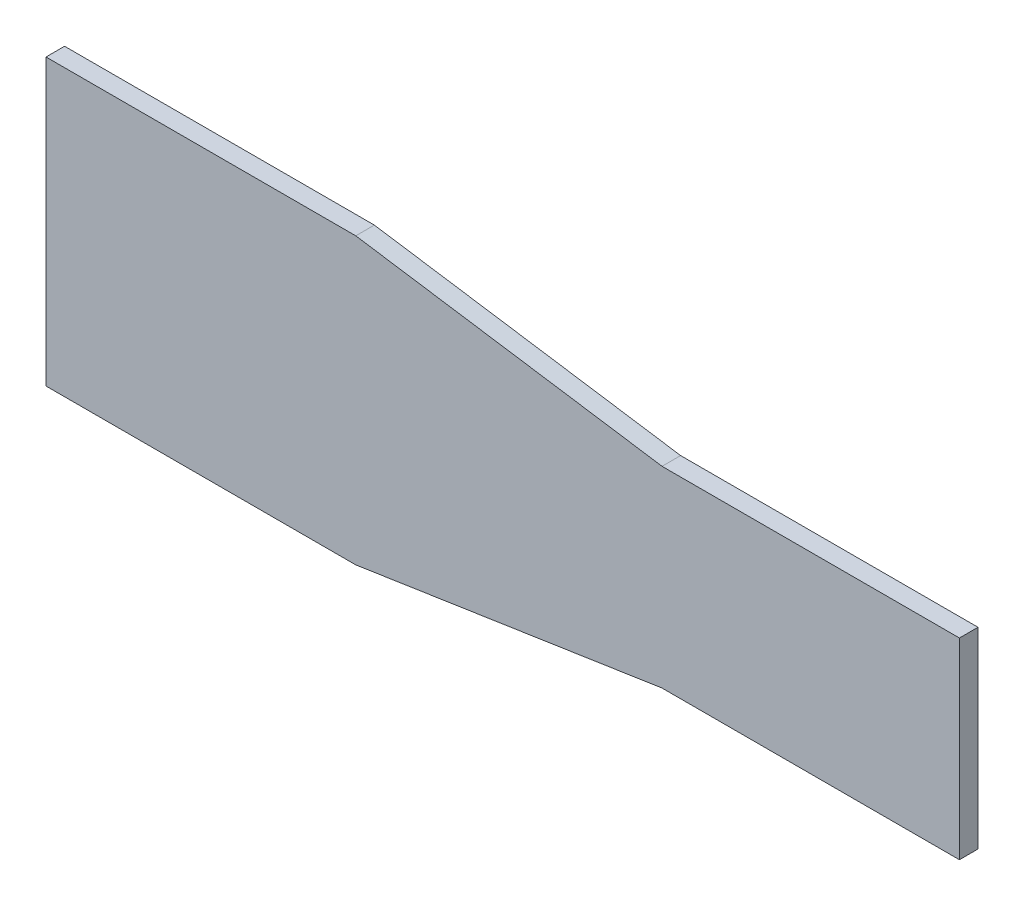
ISO-10303-21;
HEADER;
FILE_DESCRIPTION(('STEP AP214'),'2;1');
FILE_NAME('part.step','',(''),(''),'','','');
FILE_SCHEMA(('AUTOMOTIVE_DESIGN { 1 0 10303 214 1 1 1 1 }'));
ENDSEC;
DATA;
#1=APPLICATION_CONTEXT('core data for automotive mechanical design processes');
#2=APPLICATION_PROTOCOL_DEFINITION('international standard','automotive_design',2000,#1);
#3=PRODUCT_CONTEXT('',#1,'mechanical');
#4=PRODUCT('Part','Part','',(#3));
#5=PRODUCT_RELATED_PRODUCT_CATEGORY('part','',(#4));
#6=PRODUCT_DEFINITION_FORMATION('','',#4);
#7=PRODUCT_DEFINITION_CONTEXT('part definition',#1,'design');
#8=PRODUCT_DEFINITION('design','',#6,#7);
#9=PRODUCT_DEFINITION_SHAPE('','',#8);
#10=(LENGTH_UNIT() NAMED_UNIT(*) SI_UNIT(.MILLI.,.METRE.));
#11=(NAMED_UNIT(*) PLANE_ANGLE_UNIT() SI_UNIT($,.RADIAN.));
#12=(NAMED_UNIT(*) SI_UNIT($,.STERADIAN.) SOLID_ANGLE_UNIT());
#13=UNCERTAINTY_MEASURE_WITH_UNIT(LENGTH_MEASURE(1.E-05),#10,'distance_accuracy_value','');
#14=(GEOMETRIC_REPRESENTATION_CONTEXT(3) GLOBAL_UNCERTAINTY_ASSIGNED_CONTEXT((#13)) GLOBAL_UNIT_ASSIGNED_CONTEXT((#10,
#11,#12)) REPRESENTATION_CONTEXT('',''));
#15=CARTESIAN_POINT('',(0.,0.,0.));
#16=DIRECTION('',(0.,0.,1.));
#17=DIRECTION('',(1.,0.,0.));
#18=AXIS2_PLACEMENT_3D('',#15,#16,#17);
#19=CARTESIAN_POINT('',(0.,-15.5,3.));
#20=DIRECTION('',(0.,1.,0.));
#21=DIRECTION('',(-1.,0.,0.));
#22=AXIS2_PLACEMENT_3D('',#19,#20,#21);
#23=PLANE('',#22);
#24=DIRECTION('',(1.,0.,0.));
#25=VECTOR('',#24,1.);
#26=CARTESIAN_POINT('',(0.,-15.5,0.));
#27=LINE('',#26,#25);
#28=CARTESIAN_POINT('',(0.,-15.5,0.));
#29=VERTEX_POINT('',#28);
#30=CARTESIAN_POINT('',(48.,-15.5,0.));
#31=VERTEX_POINT('',#30);
#32=EDGE_CURVE('E129',#29,#31,#27,.T.);
#33=ORIENTED_EDGE('',*,*,#32,.T.);
#34=DIRECTION('',(0.,0.,-1.));
#35=VECTOR('',#34,1.);
#36=CARTESIAN_POINT('',(48.,-15.5,3.));
#37=LINE('',#36,#35);
#38=CARTESIAN_POINT('',(48.,-15.5,3.));
#39=VERTEX_POINT('',#38);
#40=EDGE_CURVE('E11',#39,#31,#37,.T.);
#41=ORIENTED_EDGE('',*,*,#40,.F.);
#42=DIRECTION('',(1.,0.,0.));
#43=VECTOR('',#42,1.);
#44=CARTESIAN_POINT('',(0.,-15.5,3.));
#45=LINE('',#44,#43);
#46=CARTESIAN_POINT('',(0.,-15.5,3.));
#47=VERTEX_POINT('',#46);
#48=EDGE_CURVE('E143',#47,#39,#45,.T.);
#49=ORIENTED_EDGE('',*,*,#48,.F.);
#50=DIRECTION('',(0.,0.,-1.));
#51=VECTOR('',#50,1.);
#52=CARTESIAN_POINT('',(0.,-15.5,3.));
#53=LINE('',#52,#51);
#54=EDGE_CURVE('E125',#47,#29,#53,.T.);
#55=ORIENTED_EDGE('',*,*,#54,.T.);
#56=EDGE_LOOP('',(#33,#41,#49,#55));
#57=FACE_BOUND('',#56,.T.);
#58=ADVANCED_FACE('F33',(#57),#23,.F.);
#59=CARTESIAN_POINT('',(48.,15.5,3.));
#60=DIRECTION('',(-1.,0.,0.));
#61=DIRECTION('',(0.,-1.,0.));
#62=AXIS2_PLACEMENT_3D('',#59,#60,#61);
#63=PLANE('',#62);
#64=DIRECTION('',(0.,1.,0.));
#65=VECTOR('',#64,1.);
#66=CARTESIAN_POINT('',(48.,15.5,0.));
#67=LINE('',#66,#65);
#68=CARTESIAN_POINT('',(48.,15.5,0.));
#69=VERTEX_POINT('',#68);
#70=EDGE_CURVE('E132',#31,#69,#67,.T.);
#71=ORIENTED_EDGE('',*,*,#70,.T.);
#72=DIRECTION('',(0.,0.,-1.));
#73=VECTOR('',#72,1.);
#74=CARTESIAN_POINT('',(48.,15.5,3.));
#75=LINE('',#74,#73);
#76=CARTESIAN_POINT('',(48.,15.5,3.));
#77=VERTEX_POINT('',#76);
#78=EDGE_CURVE('E41',#77,#69,#75,.T.);
#79=ORIENTED_EDGE('',*,*,#78,.F.);
#80=DIRECTION('',(0.,1.,0.));
#81=VECTOR('',#80,1.);
#82=CARTESIAN_POINT('',(48.,15.5,3.));
#83=LINE('',#82,#81);
#84=EDGE_CURVE('E92',#39,#77,#83,.T.);
#85=ORIENTED_EDGE('',*,*,#84,.F.);
#86=ORIENTED_EDGE('',*,*,#40,.T.);
#87=EDGE_LOOP('',(#71,#79,#85,#86));
#88=FACE_BOUND('',#87,.T.);
#89=ADVANCED_FACE('F178',(#88),#63,.F.);
#90=CARTESIAN_POINT('',(0.,15.5,3.));
#91=DIRECTION('',(0.,-1.,0.));
#92=DIRECTION('',(1.,0.,0.));
#93=AXIS2_PLACEMENT_3D('',#90,#91,#92);
#94=PLANE('',#93);
#95=DIRECTION('',(-1.,0.,0.));
#96=VECTOR('',#95,1.);
#97=CARTESIAN_POINT('',(0.,15.5,0.));
#98=LINE('',#97,#96);
#99=CARTESIAN_POINT('',(0.,15.5,0.));
#100=VERTEX_POINT('',#99);
#101=EDGE_CURVE('E134',#69,#100,#98,.T.);
#102=ORIENTED_EDGE('',*,*,#101,.T.);
#103=DIRECTION('',(0.,0.,-1.));
#104=VECTOR('',#103,1.);
#105=CARTESIAN_POINT('',(0.,15.5,3.));
#106=LINE('',#105,#104);
#107=CARTESIAN_POINT('',(0.,15.5,3.));
#108=VERTEX_POINT('',#107);
#109=EDGE_CURVE('E150',#108,#100,#106,.T.);
#110=ORIENTED_EDGE('',*,*,#109,.F.);
#111=DIRECTION('',(-1.,0.,0.));
#112=VECTOR('',#111,1.);
#113=CARTESIAN_POINT('',(0.,15.5,3.));
#114=LINE('',#113,#112);
#115=EDGE_CURVE('E158',#77,#108,#114,.T.);
#116=ORIENTED_EDGE('',*,*,#115,.F.);
#117=ORIENTED_EDGE('',*,*,#78,.T.);
#118=EDGE_LOOP('',(#102,#110,#116,#117));
#119=FACE_BOUND('',#118,.T.);
#120=ADVANCED_FACE('F156',(#119),#94,.F.);
#121=CARTESIAN_POINT('',(0.,15.5,3.));
#122=DIRECTION('',(-0.15,-0.988685996664259,0.));
#123=DIRECTION('',(0.988685996664259,-0.15,0.));
#124=AXIS2_PLACEMENT_3D('',#121,#122,#123);
#125=PLANE('',#124);
#126=DIRECTION('',(-0.988685996664259,0.15,0.));
#127=VECTOR('',#126,1.);
#128=CARTESIAN_POINT('',(0.,15.5,0.));
#129=LINE('',#128,#127);
#130=CARTESIAN_POINT('',(-49.434299833213,23.,0.));
#131=VERTEX_POINT('',#130);
#132=EDGE_CURVE('E136',#100,#131,#129,.T.);
#133=ORIENTED_EDGE('',*,*,#132,.T.);
#134=DIRECTION('',(0.,0.,-1.));
#135=VECTOR('',#134,1.);
#136=CARTESIAN_POINT('',(-49.434299833213,23.,3.));
#137=LINE('',#136,#135);
#138=CARTESIAN_POINT('',(-49.434299833213,23.,3.));
#139=VERTEX_POINT('',#138);
#140=EDGE_CURVE('E147',#139,#131,#137,.T.);
#141=ORIENTED_EDGE('',*,*,#140,.F.);
#142=DIRECTION('',(-0.988685996664259,0.15,0.));
#143=VECTOR('',#142,1.);
#144=CARTESIAN_POINT('',(0.,15.5,3.));
#145=LINE('',#144,#143);
#146=EDGE_CURVE('E170',#108,#139,#145,.T.);
#147=ORIENTED_EDGE('',*,*,#146,.F.);
#148=ORIENTED_EDGE('',*,*,#109,.T.);
#149=EDGE_LOOP('',(#133,#141,#147,#148));
#150=FACE_BOUND('',#149,.T.);
#151=ADVANCED_FACE('F166',(#150),#125,.F.);
#152=CARTESIAN_POINT('',(-49.434299833213,23.,3.));
#153=DIRECTION('',(0.,-1.,0.));
#154=DIRECTION('',(1.,0.,0.));
#155=AXIS2_PLACEMENT_3D('',#152,#153,#154);
#156=PLANE('',#155);
#157=DIRECTION('',(-1.,0.,0.));
#158=VECTOR('',#157,1.);
#159=CARTESIAN_POINT('',(-49.434299833213,23.,0.));
#160=LINE('',#159,#158);
#161=CARTESIAN_POINT('',(-99.434299833213,23.,0.));
#162=VERTEX_POINT('',#161);
#163=EDGE_CURVE('E138',#131,#162,#160,.T.);
#164=ORIENTED_EDGE('',*,*,#163,.T.);
#165=DIRECTION('',(0.,0.,-1.));
#166=VECTOR('',#165,1.);
#167=CARTESIAN_POINT('',(-99.434299833213,23.,3.));
#168=LINE('',#167,#166);
#169=CARTESIAN_POINT('',(-99.434299833213,23.,3.));
#170=VERTEX_POINT('',#169);
#171=EDGE_CURVE('E120',#170,#162,#168,.T.);
#172=ORIENTED_EDGE('',*,*,#171,.F.);
#173=DIRECTION('',(-1.,0.,0.));
#174=VECTOR('',#173,1.);
#175=CARTESIAN_POINT('',(-49.434299833213,23.,3.));
#176=LINE('',#175,#174);
#177=EDGE_CURVE('E111',#139,#170,#176,.T.);
#178=ORIENTED_EDGE('',*,*,#177,.F.);
#179=ORIENTED_EDGE('',*,*,#140,.T.);
#180=EDGE_LOOP('',(#164,#172,#178,#179));
#181=FACE_BOUND('',#180,.T.);
#182=ADVANCED_FACE('F169',(#181),#156,.F.);
#183=CARTESIAN_POINT('',(-99.434299833213,23.,3.));
#184=DIRECTION('',(1.,0.,0.));
#185=DIRECTION('',(0.,1.,0.));
#186=AXIS2_PLACEMENT_3D('',#183,#184,#185);
#187=PLANE('',#186);
#188=DIRECTION('',(0.,-1.,0.));
#189=VECTOR('',#188,1.);
#190=CARTESIAN_POINT('',(-99.434299833213,23.,0.));
#191=LINE('',#190,#189);
#192=CARTESIAN_POINT('',(-99.434299833213,-23.,0.));
#193=VERTEX_POINT('',#192);
#194=EDGE_CURVE('E119',#162,#193,#191,.T.);
#195=ORIENTED_EDGE('',*,*,#194,.T.);
#196=DIRECTION('',(0.,0.,-1.));
#197=VECTOR('',#196,1.);
#198=CARTESIAN_POINT('',(-99.434299833213,-23.,3.));
#199=LINE('',#198,#197);
#200=CARTESIAN_POINT('',(-99.434299833213,-23.,3.));
#201=VERTEX_POINT('',#200);
#202=EDGE_CURVE('E116',#201,#193,#199,.T.);
#203=ORIENTED_EDGE('',*,*,#202,.F.);
#204=DIRECTION('',(0.,-1.,0.));
#205=VECTOR('',#204,1.);
#206=CARTESIAN_POINT('',(-99.434299833213,23.,3.));
#207=LINE('',#206,#205);
#208=EDGE_CURVE('E105',#170,#201,#207,.T.);
#209=ORIENTED_EDGE('',*,*,#208,.F.);
#210=ORIENTED_EDGE('',*,*,#171,.T.);
#211=EDGE_LOOP('',(#195,#203,#209,#210));
#212=FACE_BOUND('',#211,.T.);
#213=ADVANCED_FACE('F117',(#212),#187,.F.);
#214=CARTESIAN_POINT('',(-99.434299833213,-23.,3.));
#215=DIRECTION('',(0.,1.,0.));
#216=DIRECTION('',(0.,0.,1.));
#217=AXIS2_PLACEMENT_3D('',#214,#215,#216);
#218=PLANE('',#217);
#219=DIRECTION('',(1.,0.,0.));
#220=VECTOR('',#219,1.);
#221=CARTESIAN_POINT('',(-99.434299833213,-23.,0.));
#222=LINE('',#221,#220);
#223=CARTESIAN_POINT('',(-49.434299833213,-23.,0.));
#224=VERTEX_POINT('',#223);
#225=EDGE_CURVE('E78',#193,#224,#222,.T.);
#226=ORIENTED_EDGE('',*,*,#225,.T.);
#227=DIRECTION('',(0.,0.,-1.));
#228=VECTOR('',#227,1.);
#229=CARTESIAN_POINT('',(-49.434299833213,-23.,3.));
#230=LINE('',#229,#228);
#231=CARTESIAN_POINT('',(-49.434299833213,-23.,3.));
#232=VERTEX_POINT('',#231);
#233=EDGE_CURVE('E121',#232,#224,#230,.T.);
#234=ORIENTED_EDGE('',*,*,#233,.F.);
#235=DIRECTION('',(1.,0.,0.));
#236=VECTOR('',#235,1.);
#237=CARTESIAN_POINT('',(-99.434299833213,-23.,3.));
#238=LINE('',#237,#236);
#239=EDGE_CURVE('E109',#201,#232,#238,.T.);
#240=ORIENTED_EDGE('',*,*,#239,.F.);
#241=ORIENTED_EDGE('',*,*,#202,.T.);
#242=EDGE_LOOP('',(#226,#234,#240,#241));
#243=FACE_BOUND('',#242,.T.);
#244=ADVANCED_FACE('F123',(#243),#218,.F.);
#245=CARTESIAN_POINT('',(-49.434299833213,-23.,3.));
#246=DIRECTION('',(-0.15,0.988685996664259,0.));
#247=DIRECTION('',(-0.988685996664259,-0.15,0.));
#248=AXIS2_PLACEMENT_3D('',#245,#246,#247);
#249=PLANE('',#248);
#250=DIRECTION('',(0.988685996664259,0.15,0.));
#251=VECTOR('',#250,1.);
#252=CARTESIAN_POINT('',(-49.434299833213,-23.,0.));
#253=LINE('',#252,#251);
#254=EDGE_CURVE('E84',#224,#29,#253,.T.);
#255=ORIENTED_EDGE('',*,*,#254,.T.);
#256=ORIENTED_EDGE('',*,*,#54,.F.);
#257=DIRECTION('',(0.988685996664259,0.15,0.));
#258=VECTOR('',#257,1.);
#259=CARTESIAN_POINT('',(-49.434299833213,-23.,3.));
#260=LINE('',#259,#258);
#261=EDGE_CURVE('E49',#232,#47,#260,.T.);
#262=ORIENTED_EDGE('',*,*,#261,.F.);
#263=ORIENTED_EDGE('',*,*,#233,.T.);
#264=EDGE_LOOP('',(#255,#256,#262,#263));
#265=FACE_BOUND('',#264,.T.);
#266=ADVANCED_FACE('F194',(#265),#249,.F.);
#267=CARTESIAN_POINT('',(0.,0.,3.));
#268=DIRECTION('',(0.,0.,-1.));
#269=DIRECTION('',(-1.,0.,0.));
#270=AXIS2_PLACEMENT_3D('',#267,#268,#269);
#271=PLANE('',#270);
#272=ORIENTED_EDGE('',*,*,#48,.T.);
#273=ORIENTED_EDGE('',*,*,#84,.T.);
#274=ORIENTED_EDGE('',*,*,#115,.T.);
#275=ORIENTED_EDGE('',*,*,#146,.T.);
#276=ORIENTED_EDGE('',*,*,#177,.T.);
#277=ORIENTED_EDGE('',*,*,#208,.T.);
#278=ORIENTED_EDGE('',*,*,#239,.T.);
#279=ORIENTED_EDGE('',*,*,#261,.T.);
#280=EDGE_LOOP('',(#272,#273,#274,#275,#276,#277,#278,#279));
#281=FACE_BOUND('',#280,.T.);
#282=ADVANCED_FACE('F107',(#281),#271,.F.);
#283=CARTESIAN_POINT('',(0.,0.,0.));
#284=DIRECTION('',(0.,0.,-1.));
#285=DIRECTION('',(-1.,0.,0.));
#286=AXIS2_PLACEMENT_3D('',#283,#284,#285);
#287=PLANE('',#286);
#288=ORIENTED_EDGE('',*,*,#32,.F.);
#289=ORIENTED_EDGE('',*,*,#254,.F.);
#290=ORIENTED_EDGE('',*,*,#225,.F.);
#291=ORIENTED_EDGE('',*,*,#194,.F.);
#292=ORIENTED_EDGE('',*,*,#163,.F.);
#293=ORIENTED_EDGE('',*,*,#132,.F.);
#294=ORIENTED_EDGE('',*,*,#101,.F.);
#295=ORIENTED_EDGE('',*,*,#70,.F.);
#296=EDGE_LOOP('',(#288,#289,#290,#291,#292,#293,#294,#295));
#297=FACE_BOUND('',#296,.T.);
#298=ADVANCED_FACE('F162',(#297),#287,.T.);
#299=CLOSED_SHELL('',(#58,#89,#120,#151,#182,#213,#244,#266,#282,#298));
#300=MANIFOLD_SOLID_BREP('B2',#299);
#301=ADVANCED_BREP_SHAPE_REPRESENTATION('',(#18,#300),#14);
#302=SHAPE_DEFINITION_REPRESENTATION(#9,#301);
ENDSEC;
END-ISO-10303-21;
